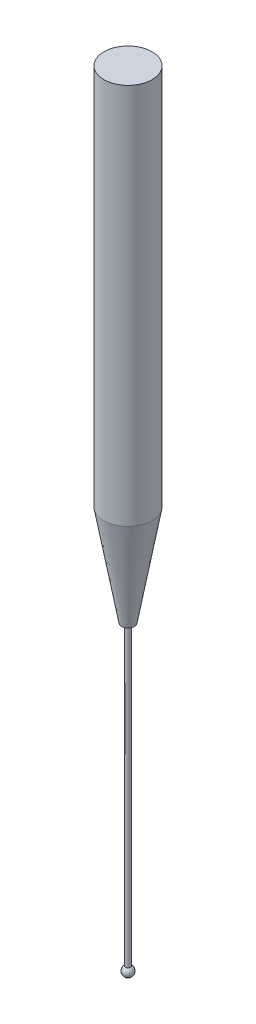
ISO-10303-21;
HEADER;
FILE_DESCRIPTION(('STEP AP214'),'2;1');
FILE_NAME('part.step','',(''),(''),'','','');
FILE_SCHEMA(('AUTOMOTIVE_DESIGN { 1 0 10303 214 1 1 1 1 }'));
ENDSEC;
DATA;
#1=APPLICATION_CONTEXT('core data for automotive mechanical design processes');
#2=APPLICATION_PROTOCOL_DEFINITION('international standard','automotive_design',2000,#1);
#3=PRODUCT_CONTEXT('',#1,'mechanical');
#4=PRODUCT('Part','Part','',(#3));
#5=PRODUCT_RELATED_PRODUCT_CATEGORY('part','',(#4));
#6=PRODUCT_DEFINITION_FORMATION('','',#4);
#7=PRODUCT_DEFINITION_CONTEXT('part definition',#1,'design');
#8=PRODUCT_DEFINITION('design','',#6,#7);
#9=PRODUCT_DEFINITION_SHAPE('','',#8);
#10=(LENGTH_UNIT() NAMED_UNIT(*) SI_UNIT(.MILLI.,.METRE.));
#11=(NAMED_UNIT(*) PLANE_ANGLE_UNIT() SI_UNIT($,.RADIAN.));
#12=(NAMED_UNIT(*) SI_UNIT($,.STERADIAN.) SOLID_ANGLE_UNIT());
#13=UNCERTAINTY_MEASURE_WITH_UNIT(LENGTH_MEASURE(1.E-05),#10,'distance_accuracy_value','');
#14=(GEOMETRIC_REPRESENTATION_CONTEXT(3) GLOBAL_UNCERTAINTY_ASSIGNED_CONTEXT((#13)) GLOBAL_UNIT_ASSIGNED_CONTEXT((#10,
#11,#12)) REPRESENTATION_CONTEXT('',''));
#15=CARTESIAN_POINT('',(0.,0.,0.));
#16=DIRECTION('',(0.,0.,1.));
#17=DIRECTION('',(1.,0.,0.));
#18=AXIS2_PLACEMENT_3D('',#15,#16,#17);
#19=CARTESIAN_POINT('',(0.,-78.,0.));
#20=DIRECTION('',(0.,-1.,0.));
#21=DIRECTION('',(1.,0.,0.));
#22=AXIS2_PLACEMENT_3D('',#19,#20,#21);
#23=SPHERICAL_SURFACE('',#22,0.5);
#24=CARTESIAN_POINT('',(2.66074924532601E-13,-77.5672333463342,0.));
#25=DIRECTION('',(0.,-1.,0.));
#26=DIRECTION('',(1.,0.,0.));
#27=AXIS2_PLACEMENT_3D('',#24,#25,#26);
#28=CIRCLE('',#27,0.250425684534892);
#29=CARTESIAN_POINT('',(0.250425684535158,-77.5672333463342,0.));
#30=VERTEX_POINT('',#29);
#31=EDGE_CURVE('E10',#30,#30,#28,.T.);
#32=ORIENTED_EDGE('',*,*,#31,.T.);
#33=EDGE_LOOP('',(#32));
#34=FACE_BOUND('',#33,.T.);
#35=ADVANCED_FACE('F43',(#34),#23,.T.);
#36=CARTESIAN_POINT('',(5.35703185935118E-13,-156.170349764442,0.));
#37=DIRECTION('',(0.,-1.,0.));
#38=DIRECTION('',(1.,0.,0.));
#39=AXIS2_PLACEMENT_3D('',#36,#37,#38);
#40=CYLINDRICAL_SURFACE('',#39,0.250425684534941);
#41=CARTESIAN_POINT('',(1.64651951946517E-13,-48.,0.));
#42=DIRECTION('',(0.,-1.,0.));
#43=DIRECTION('',(1.,0.,0.));
#44=AXIS2_PLACEMENT_3D('',#41,#42,#43);
#45=CIRCLE('',#44,0.25042568453499);
#46=CARTESIAN_POINT('',(0.250425684535154,-48.,0.));
#47=VERTEX_POINT('',#46);
#48=EDGE_CURVE('E49',#47,#47,#45,.T.);
#49=ORIENTED_EDGE('',*,*,#48,.T.);
#50=EDGE_LOOP('',(#49));
#51=FACE_BOUND('',#50,.T.);
#52=ORIENTED_EDGE('',*,*,#31,.F.);
#53=EDGE_LOOP('',(#52));
#54=FACE_BOUND('',#53,.T.);
#55=ADVANCED_FACE('F79',(#51,#54),#40,.T.);
#56=CARTESIAN_POINT('',(0.636730192915348,-48.,0.));
#57=DIRECTION('',(0.,-1.,0.));
#58=DIRECTION('',(1.,0.,0.));
#59=AXIS2_PLACEMENT_3D('',#56,#57,#58);
#60=PLANE('',#59);
#61=CARTESIAN_POINT('',(1.64651951946517E-13,-48.,0.));
#62=DIRECTION('',(0.,-1.,0.));
#63=DIRECTION('',(1.,0.,0.));
#64=AXIS2_PLACEMENT_3D('',#61,#62,#63);
#65=CIRCLE('',#64,0.636730192915183);
#66=CARTESIAN_POINT('',(0.636730192915348,-48.,0.));
#67=VERTEX_POINT('',#66);
#68=EDGE_CURVE('E53',#67,#67,#65,.T.);
#69=ORIENTED_EDGE('',*,*,#68,.T.);
#70=EDGE_LOOP('',(#69));
#71=FACE_BOUND('',#70,.T.);
#72=ORIENTED_EDGE('',*,*,#48,.F.);
#73=EDGE_LOOP('',(#72));
#74=FACE_BOUND('',#73,.T.);
#75=ADVANCED_FACE('F83',(#71,#74),#60,.T.);
#76=CARTESIAN_POINT('',(1.64651951946517E-13,-48.,0.));
#77=DIRECTION('',(0.,1.,0.));
#78=DIRECTION('',(-1.,0.,0.));
#79=AXIS2_PLACEMENT_3D('',#76,#77,#78);
#80=CONICAL_SURFACE('',#79,0.636730192915183,0.174532925199437);
#81=CARTESIAN_POINT('',(1.30349461957659E-13,-38.,0.));
#82=DIRECTION('',(0.,-1.,0.));
#83=DIRECTION('',(1.,0.,0.));
#84=AXIS2_PLACEMENT_3D('',#81,#82,#83);
#85=CIRCLE('',#84,2.39999999999987);
#86=CARTESIAN_POINT('',(2.4,-38.,0.));
#87=VERTEX_POINT('',#86);
#88=EDGE_CURVE('E57',#87,#87,#85,.T.);
#89=ORIENTED_EDGE('',*,*,#88,.T.);
#90=EDGE_LOOP('',(#89));
#91=FACE_BOUND('',#90,.T.);
#92=ORIENTED_EDGE('',*,*,#68,.F.);
#93=EDGE_LOOP('',(#92));
#94=FACE_BOUND('',#93,.T.);
#95=ADVANCED_FACE('F76',(#91,#94),#80,.T.);
#96=CARTESIAN_POINT('',(5.35703185935118E-13,-156.170349764442,0.));
#97=DIRECTION('',(0.,-1.,0.));
#98=DIRECTION('',(1.,0.,0.));
#99=AXIS2_PLACEMENT_3D('',#96,#97,#98);
#100=CYLINDRICAL_SURFACE('',#99,2.39999999999995);
#101=CARTESIAN_POINT('',(0.,0.,0.));
#102=DIRECTION('',(0.,-1.,0.));
#103=DIRECTION('',(1.,0.,0.));
#104=AXIS2_PLACEMENT_3D('',#101,#102,#103);
#105=CIRCLE('',#104,2.40000000000002);
#106=CARTESIAN_POINT('',(2.40000000000002,0.,0.));
#107=VERTEX_POINT('',#106);
#108=EDGE_CURVE('E62',#107,#107,#105,.T.);
#109=ORIENTED_EDGE('',*,*,#108,.T.);
#110=EDGE_LOOP('',(#109));
#111=FACE_BOUND('',#110,.T.);
#112=ORIENTED_EDGE('',*,*,#88,.F.);
#113=EDGE_LOOP('',(#112));
#114=FACE_BOUND('',#113,.T.);
#115=ADVANCED_FACE('F66',(#111,#114),#100,.T.);
#116=CARTESIAN_POINT('',(0.,0.,0.));
#117=DIRECTION('',(0.,1.,0.));
#118=DIRECTION('',(-1.,0.,0.));
#119=AXIS2_PLACEMENT_3D('',#116,#117,#118);
#120=PLANE('',#119);
#121=ORIENTED_EDGE('',*,*,#108,.F.);
#122=EDGE_LOOP('',(#121));
#123=FACE_BOUND('',#122,.T.);
#124=ADVANCED_FACE('F69',(#123),#120,.T.);
#125=CLOSED_SHELL('',(#35,#55,#75,#95,#115,#124));
#126=MANIFOLD_SOLID_BREP('B2',#125);
#127=ADVANCED_BREP_SHAPE_REPRESENTATION('',(#18,#126),#14);
#128=SHAPE_DEFINITION_REPRESENTATION(#9,#127);
ENDSEC;
END-ISO-10303-21;
